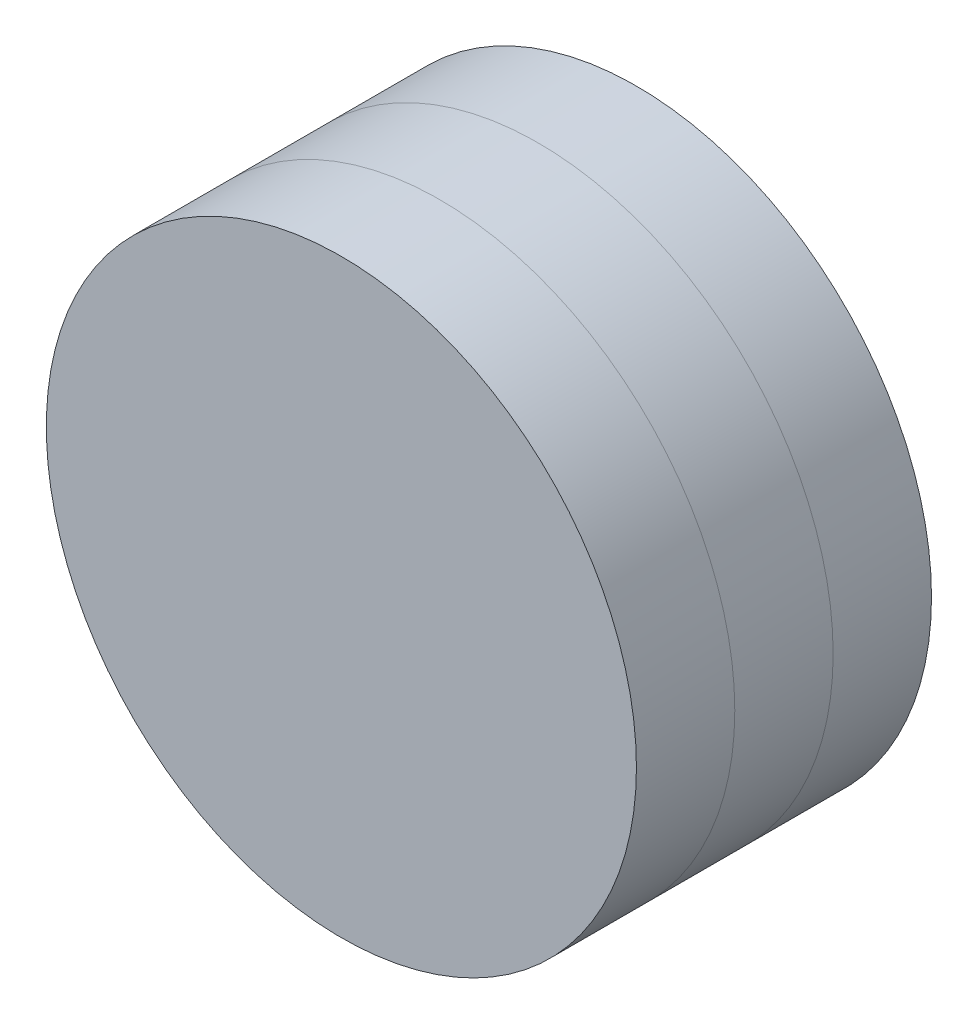
ISO-10303-21;
HEADER;
FILE_DESCRIPTION(('STEP AP214'),'2;1');
FILE_NAME('part.step','',(''),(''),'','','');
FILE_SCHEMA(('AUTOMOTIVE_DESIGN { 1 0 10303 214 1 1 1 1 }'));
ENDSEC;
DATA;
#1=APPLICATION_CONTEXT('core data for automotive mechanical design processes');
#2=APPLICATION_PROTOCOL_DEFINITION('international standard','automotive_design',2000,#1);
#3=PRODUCT_CONTEXT('',#1,'mechanical');
#4=PRODUCT('Part','Part','',(#3));
#5=PRODUCT_RELATED_PRODUCT_CATEGORY('part','',(#4));
#6=PRODUCT_DEFINITION_FORMATION('','',#4);
#7=PRODUCT_DEFINITION_CONTEXT('part definition',#1,'design');
#8=PRODUCT_DEFINITION('design','',#6,#7);
#9=PRODUCT_DEFINITION_SHAPE('','',#8);
#10=(LENGTH_UNIT() NAMED_UNIT(*) SI_UNIT(.MILLI.,.METRE.));
#11=(NAMED_UNIT(*) PLANE_ANGLE_UNIT() SI_UNIT($,.RADIAN.));
#12=(NAMED_UNIT(*) SI_UNIT($,.STERADIAN.) SOLID_ANGLE_UNIT());
#13=UNCERTAINTY_MEASURE_WITH_UNIT(LENGTH_MEASURE(1.E-05),#10,'distance_accuracy_value','');
#14=(GEOMETRIC_REPRESENTATION_CONTEXT(3) GLOBAL_UNCERTAINTY_ASSIGNED_CONTEXT((#13)) GLOBAL_UNIT_ASSIGNED_CONTEXT((#10,
#11,#12)) REPRESENTATION_CONTEXT('',''));
#15=CARTESIAN_POINT('',(0.,0.,0.));
#16=DIRECTION('',(0.,0.,1.));
#17=DIRECTION('',(1.,0.,0.));
#18=AXIS2_PLACEMENT_3D('',#15,#16,#17);
#19=CARTESIAN_POINT('',(0.,0.,60.));
#20=DIRECTION('',(0.,0.,-1.));
#21=DIRECTION('',(-1.,0.,0.));
#22=AXIS2_PLACEMENT_3D('',#19,#20,#21);
#23=CYLINDRICAL_SURFACE('',#22,60.);
#24=CARTESIAN_POINT('',(0.,0.,60.));
#25=DIRECTION('',(0.,0.,1.));
#26=DIRECTION('',(1.,0.,0.));
#27=AXIS2_PLACEMENT_3D('',#24,#25,#26);
#28=CIRCLE('',#27,60.);
#29=CARTESIAN_POINT('',(60.,0.,60.));
#30=VERTEX_POINT('',#29);
#31=EDGE_CURVE('E11',#30,#30,#28,.T.);
#32=ORIENTED_EDGE('',*,*,#31,.F.);
#33=EDGE_LOOP('',(#32));
#34=FACE_BOUND('',#33,.T.);
#35=CARTESIAN_POINT('',(0.,0.,40.));
#36=DIRECTION('',(0.,0.,1.));
#37=DIRECTION('',(1.,0.,0.));
#38=AXIS2_PLACEMENT_3D('',#35,#36,#37);
#39=CIRCLE('',#38,60.);
#40=CARTESIAN_POINT('',(60.,0.,40.));
#41=VERTEX_POINT('',#40);
#42=EDGE_CURVE('E43',#41,#41,#39,.T.);
#43=ORIENTED_EDGE('',*,*,#42,.T.);
#44=EDGE_LOOP('',(#43));
#45=FACE_BOUND('',#44,.T.);
#46=ADVANCED_FACE('F40',(#34,#45),#23,.T.);
#47=CARTESIAN_POINT('',(0.,0.,60.));
#48=DIRECTION('',(0.,0.,1.));
#49=DIRECTION('',(1.,0.,0.));
#50=AXIS2_PLACEMENT_3D('',#47,#48,#49);
#51=PLANE('',#50);
#52=ORIENTED_EDGE('',*,*,#31,.T.);
#53=EDGE_LOOP('',(#52));
#54=FACE_BOUND('',#53,.T.);
#55=ADVANCED_FACE('F55',(#54),#51,.T.);
#56=CARTESIAN_POINT('',(0.,0.,40.));
#57=DIRECTION('',(0.,0.,1.));
#58=DIRECTION('',(1.,0.,0.));
#59=AXIS2_PLACEMENT_3D('',#56,#57,#58);
#60=PLANE('',#59);
#61=ORIENTED_EDGE('',*,*,#42,.F.);
#62=EDGE_LOOP('',(#61));
#63=FACE_BOUND('',#62,.T.);
#64=ADVANCED_FACE('F53',(#63),#60,.F.);
#65=CLOSED_SHELL('',(#46,#55,#64));
#66=MANIFOLD_SOLID_BREP('B2',#65);
#67=CARTESIAN_POINT('',(0.,0.,40.));
#68=DIRECTION('',(0.,0.,-1.));
#69=DIRECTION('',(-1.,0.,0.));
#70=AXIS2_PLACEMENT_3D('',#67,#68,#69);
#71=CYLINDRICAL_SURFACE('',#70,60.);
#72=CARTESIAN_POINT('',(0.,0.,40.));
#73=DIRECTION('',(0.,0.,1.));
#74=DIRECTION('',(1.,0.,0.));
#75=AXIS2_PLACEMENT_3D('',#72,#73,#74);
#76=CIRCLE('',#75,60.);
#77=CARTESIAN_POINT('',(60.,0.,40.));
#78=VERTEX_POINT('',#77);
#79=EDGE_CURVE('E39',#78,#78,#76,.T.);
#80=ORIENTED_EDGE('',*,*,#79,.F.);
#81=EDGE_LOOP('',(#80));
#82=FACE_BOUND('',#81,.T.);
#83=CARTESIAN_POINT('',(0.,0.,20.));
#84=DIRECTION('',(0.,0.,1.));
#85=DIRECTION('',(1.,0.,0.));
#86=AXIS2_PLACEMENT_3D('',#83,#84,#85);
#87=CIRCLE('',#86,60.);
#88=CARTESIAN_POINT('',(60.,0.,20.));
#89=VERTEX_POINT('',#88);
#90=EDGE_CURVE('E91',#89,#89,#87,.T.);
#91=ORIENTED_EDGE('',*,*,#90,.T.);
#92=EDGE_LOOP('',(#91));
#93=FACE_BOUND('',#92,.T.);
#94=ADVANCED_FACE('F88',(#82,#93),#71,.T.);
#95=CARTESIAN_POINT('',(0.,0.,40.));
#96=DIRECTION('',(0.,0.,1.));
#97=DIRECTION('',(1.,0.,0.));
#98=AXIS2_PLACEMENT_3D('',#95,#96,#97);
#99=PLANE('',#98);
#100=ORIENTED_EDGE('',*,*,#79,.T.);
#101=EDGE_LOOP('',(#100));
#102=FACE_BOUND('',#101,.T.);
#103=ADVANCED_FACE('F103',(#102),#99,.T.);
#104=CARTESIAN_POINT('',(0.,0.,20.));
#105=DIRECTION('',(0.,0.,1.));
#106=DIRECTION('',(1.,0.,0.));
#107=AXIS2_PLACEMENT_3D('',#104,#105,#106);
#108=PLANE('',#107);
#109=ORIENTED_EDGE('',*,*,#90,.F.);
#110=EDGE_LOOP('',(#109));
#111=FACE_BOUND('',#110,.T.);
#112=ADVANCED_FACE('F101',(#111),#108,.F.);
#113=CLOSED_SHELL('',(#94,#103,#112));
#114=MANIFOLD_SOLID_BREP('B6',#113);
#115=CARTESIAN_POINT('',(0.,0.,20.));
#116=DIRECTION('',(0.,0.,-1.));
#117=DIRECTION('',(-1.,0.,0.));
#118=AXIS2_PLACEMENT_3D('',#115,#116,#117);
#119=CYLINDRICAL_SURFACE('',#118,60.);
#120=CARTESIAN_POINT('',(0.,0.,20.));
#121=DIRECTION('',(0.,0.,1.));
#122=DIRECTION('',(1.,0.,0.));
#123=AXIS2_PLACEMENT_3D('',#120,#121,#122);
#124=CIRCLE('',#123,60.);
#125=CARTESIAN_POINT('',(60.,0.,20.));
#126=VERTEX_POINT('',#125);
#127=EDGE_CURVE('E87',#126,#126,#124,.T.);
#128=ORIENTED_EDGE('',*,*,#127,.F.);
#129=EDGE_LOOP('',(#128));
#130=FACE_BOUND('',#129,.T.);
#131=CARTESIAN_POINT('',(0.,0.,0.));
#132=DIRECTION('',(0.,0.,1.));
#133=DIRECTION('',(1.,0.,0.));
#134=AXIS2_PLACEMENT_3D('',#131,#132,#133);
#135=CIRCLE('',#134,60.);
#136=CARTESIAN_POINT('',(60.,0.,0.));
#137=VERTEX_POINT('',#136);
#138=EDGE_CURVE('E132',#137,#137,#135,.T.);
#139=ORIENTED_EDGE('',*,*,#138,.T.);
#140=EDGE_LOOP('',(#139));
#141=FACE_BOUND('',#140,.T.);
#142=ADVANCED_FACE('F129',(#130,#141),#119,.T.);
#143=CARTESIAN_POINT('',(0.,0.,20.));
#144=DIRECTION('',(0.,0.,1.));
#145=DIRECTION('',(1.,0.,0.));
#146=AXIS2_PLACEMENT_3D('',#143,#144,#145);
#147=PLANE('',#146);
#148=ORIENTED_EDGE('',*,*,#127,.T.);
#149=EDGE_LOOP('',(#148));
#150=FACE_BOUND('',#149,.T.);
#151=ADVANCED_FACE('F144',(#150),#147,.T.);
#152=CARTESIAN_POINT('',(0.,0.,0.));
#153=DIRECTION('',(0.,0.,1.));
#154=DIRECTION('',(1.,0.,0.));
#155=AXIS2_PLACEMENT_3D('',#152,#153,#154);
#156=PLANE('',#155);
#157=ORIENTED_EDGE('',*,*,#138,.F.);
#158=EDGE_LOOP('',(#157));
#159=FACE_BOUND('',#158,.T.);
#160=ADVANCED_FACE('F142',(#159),#156,.F.);
#161=CLOSED_SHELL('',(#142,#151,#160));
#162=MANIFOLD_SOLID_BREP('B34',#161);
#163=ADVANCED_BREP_SHAPE_REPRESENTATION('',(#18,#66,#114,#162),#14);
#164=SHAPE_DEFINITION_REPRESENTATION(#9,#163);
ENDSEC;
END-ISO-10303-21;
